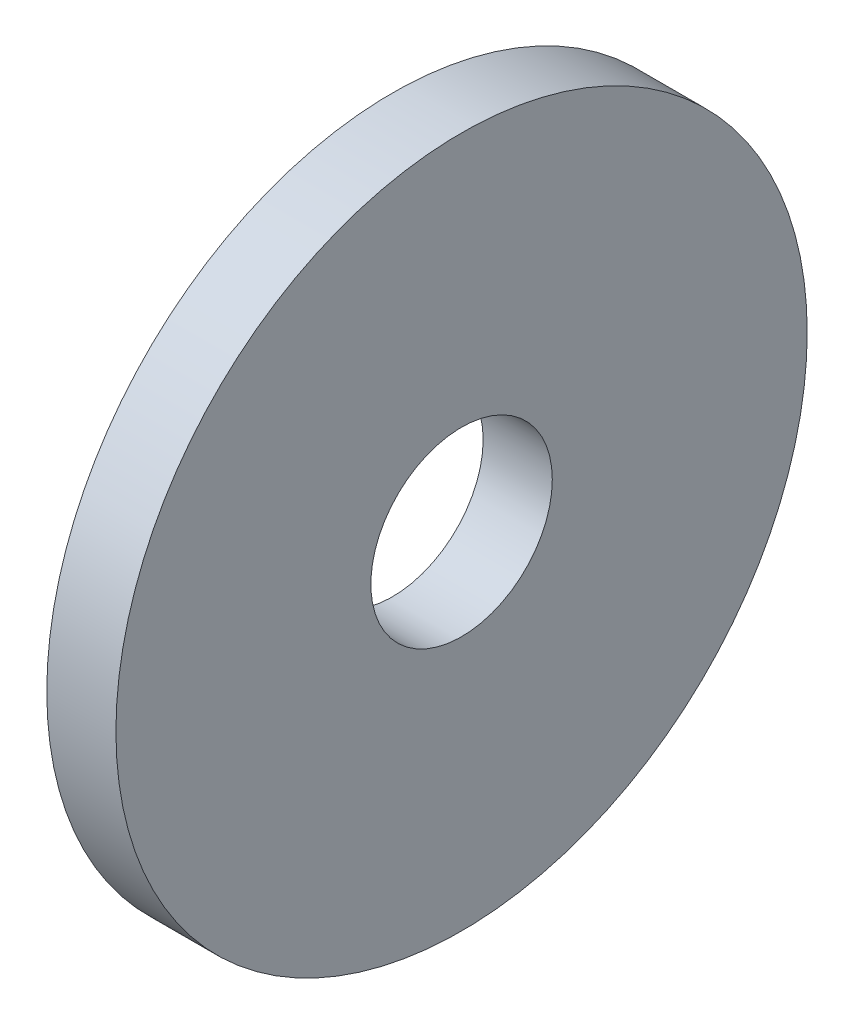
ISO-10303-21;
HEADER;
FILE_DESCRIPTION(('STEP AP214'),'2;1');
FILE_NAME('part.step','',(''),(''),'','','');
FILE_SCHEMA(('AUTOMOTIVE_DESIGN { 1 0 10303 214 1 1 1 1 }'));
ENDSEC;
DATA;
#1=APPLICATION_CONTEXT('core data for automotive mechanical design processes');
#2=APPLICATION_PROTOCOL_DEFINITION('international standard','automotive_design',2000,#1);
#3=PRODUCT_CONTEXT('',#1,'mechanical');
#4=PRODUCT('Part','Part','',(#3));
#5=PRODUCT_RELATED_PRODUCT_CATEGORY('part','',(#4));
#6=PRODUCT_DEFINITION_FORMATION('','',#4);
#7=PRODUCT_DEFINITION_CONTEXT('part definition',#1,'design');
#8=PRODUCT_DEFINITION('design','',#6,#7);
#9=PRODUCT_DEFINITION_SHAPE('','',#8);
#10=(LENGTH_UNIT() NAMED_UNIT(*) SI_UNIT(.MILLI.,.METRE.));
#11=(NAMED_UNIT(*) PLANE_ANGLE_UNIT() SI_UNIT($,.RADIAN.));
#12=(NAMED_UNIT(*) SI_UNIT($,.STERADIAN.) SOLID_ANGLE_UNIT());
#13=UNCERTAINTY_MEASURE_WITH_UNIT(LENGTH_MEASURE(1.E-05),#10,'distance_accuracy_value','');
#14=(GEOMETRIC_REPRESENTATION_CONTEXT(3) GLOBAL_UNCERTAINTY_ASSIGNED_CONTEXT((#13)) GLOBAL_UNIT_ASSIGNED_CONTEXT((#10,
#11,#12)) REPRESENTATION_CONTEXT('',''));
#15=CARTESIAN_POINT('',(0.,0.,0.));
#16=DIRECTION('',(0.,0.,1.));
#17=DIRECTION('',(1.,0.,0.));
#18=AXIS2_PLACEMENT_3D('',#15,#16,#17);
#19=CARTESIAN_POINT('',(-4.,0.,0.));
#20=DIRECTION('',(1.,0.,0.));
#21=DIRECTION('',(0.,0.,-1.));
#22=AXIS2_PLACEMENT_3D('',#19,#20,#21);
#23=CYLINDRICAL_SURFACE('',#22,20.);
#24=CARTESIAN_POINT('',(-4.,0.,0.));
#25=DIRECTION('',(1.,0.,0.));
#26=DIRECTION('',(0.,0.,-1.));
#27=AXIS2_PLACEMENT_3D('',#24,#25,#26);
#28=CIRCLE('',#27,20.);
#29=CARTESIAN_POINT('',(-4.,0.,-20.));
#30=VERTEX_POINT('',#29);
#31=EDGE_CURVE('E10',#30,#30,#28,.T.);
#32=ORIENTED_EDGE('',*,*,#31,.T.);
#33=EDGE_LOOP('',(#32));
#34=FACE_BOUND('',#33,.T.);
#35=CARTESIAN_POINT('',(0.,0.,0.));
#36=DIRECTION('',(1.,0.,0.));
#37=DIRECTION('',(0.,0.,-1.));
#38=AXIS2_PLACEMENT_3D('',#35,#36,#37);
#39=CIRCLE('',#38,20.);
#40=CARTESIAN_POINT('',(0.,0.,-20.));
#41=VERTEX_POINT('',#40);
#42=EDGE_CURVE('E38',#41,#41,#39,.T.);
#43=ORIENTED_EDGE('',*,*,#42,.F.);
#44=EDGE_LOOP('',(#43));
#45=FACE_BOUND('',#44,.T.);
#46=ADVANCED_FACE('F35',(#34,#45),#23,.T.);
#47=CARTESIAN_POINT('',(-4.,0.,0.));
#48=DIRECTION('',(1.,0.,0.));
#49=DIRECTION('',(0.,0.,-1.));
#50=AXIS2_PLACEMENT_3D('',#47,#48,#49);
#51=PLANE('',#50);
#52=CARTESIAN_POINT('',(-4.,0.,0.));
#53=DIRECTION('',(1.,0.,0.));
#54=DIRECTION('',(0.,0.,-1.));
#55=AXIS2_PLACEMENT_3D('',#52,#53,#54);
#56=CIRCLE('',#55,5.25);
#57=CARTESIAN_POINT('',(-4.,0.,-5.25));
#58=VERTEX_POINT('',#57);
#59=EDGE_CURVE('E45',#58,#58,#56,.T.);
#60=ORIENTED_EDGE('',*,*,#59,.T.);
#61=EDGE_LOOP('',(#60));
#62=FACE_BOUND('',#61,.T.);
#63=ORIENTED_EDGE('',*,*,#31,.F.);
#64=EDGE_LOOP('',(#63));
#65=FACE_BOUND('',#64,.T.);
#66=ADVANCED_FACE('F53',(#62,#65),#51,.F.);
#67=CARTESIAN_POINT('',(0.,0.,0.));
#68=DIRECTION('',(1.,0.,0.));
#69=DIRECTION('',(0.,0.,-1.));
#70=AXIS2_PLACEMENT_3D('',#67,#68,#69);
#71=PLANE('',#70);
#72=CARTESIAN_POINT('',(0.,0.,0.));
#73=DIRECTION('',(1.,0.,0.));
#74=DIRECTION('',(0.,0.,-1.));
#75=AXIS2_PLACEMENT_3D('',#72,#73,#74);
#76=CIRCLE('',#75,5.25);
#77=CARTESIAN_POINT('',(0.,0.,-5.25));
#78=VERTEX_POINT('',#77);
#79=EDGE_CURVE('E47',#78,#78,#76,.T.);
#80=ORIENTED_EDGE('',*,*,#79,.F.);
#81=EDGE_LOOP('',(#80));
#82=FACE_BOUND('',#81,.T.);
#83=ORIENTED_EDGE('',*,*,#42,.T.);
#84=EDGE_LOOP('',(#83));
#85=FACE_BOUND('',#84,.T.);
#86=ADVANCED_FACE('F59',(#82,#85),#71,.T.);
#87=CARTESIAN_POINT('',(-4.,0.,0.));
#88=DIRECTION('',(1.,0.,0.));
#89=DIRECTION('',(0.,0.,-1.));
#90=AXIS2_PLACEMENT_3D('',#87,#88,#89);
#91=CYLINDRICAL_SURFACE('',#90,5.25);
#92=ORIENTED_EDGE('',*,*,#59,.F.);
#93=EDGE_LOOP('',(#92));
#94=FACE_BOUND('',#93,.T.);
#95=ORIENTED_EDGE('',*,*,#79,.T.);
#96=EDGE_LOOP('',(#95));
#97=FACE_BOUND('',#96,.T.);
#98=ADVANCED_FACE('F56',(#94,#97),#91,.F.);
#99=CLOSED_SHELL('',(#46,#66,#86,#98));
#100=MANIFOLD_SOLID_BREP('B2',#99);
#101=ADVANCED_BREP_SHAPE_REPRESENTATION('',(#18,#100),#14);
#102=SHAPE_DEFINITION_REPRESENTATION(#9,#101);
ENDSEC;
END-ISO-10303-21;
